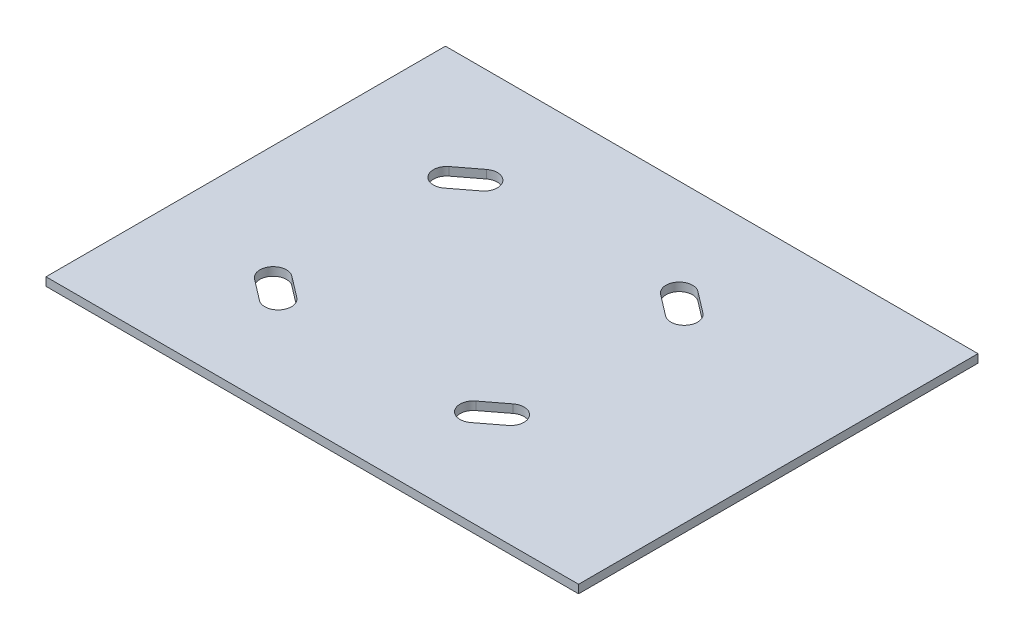
ISO-10303-21;
HEADER;
FILE_DESCRIPTION(('STEP AP214'),'2;1');
FILE_NAME('part.step','',(''),(''),'','','');
FILE_SCHEMA(('AUTOMOTIVE_DESIGN { 1 0 10303 214 1 1 1 1 }'));
ENDSEC;
DATA;
#1=APPLICATION_CONTEXT('core data for automotive mechanical design processes');
#2=APPLICATION_PROTOCOL_DEFINITION('international standard','automotive_design',2000,#1);
#3=PRODUCT_CONTEXT('',#1,'mechanical');
#4=PRODUCT('Part','Part','',(#3));
#5=PRODUCT_RELATED_PRODUCT_CATEGORY('part','',(#4));
#6=PRODUCT_DEFINITION_FORMATION('','',#4);
#7=PRODUCT_DEFINITION_CONTEXT('part definition',#1,'design');
#8=PRODUCT_DEFINITION('design','',#6,#7);
#9=PRODUCT_DEFINITION_SHAPE('','',#8);
#10=(LENGTH_UNIT() NAMED_UNIT(*) SI_UNIT(.MILLI.,.METRE.));
#11=(NAMED_UNIT(*) PLANE_ANGLE_UNIT() SI_UNIT($,.RADIAN.));
#12=(NAMED_UNIT(*) SI_UNIT($,.STERADIAN.) SOLID_ANGLE_UNIT());
#13=UNCERTAINTY_MEASURE_WITH_UNIT(LENGTH_MEASURE(1.E-05),#10,'distance_accuracy_value','');
#14=(GEOMETRIC_REPRESENTATION_CONTEXT(3) GLOBAL_UNCERTAINTY_ASSIGNED_CONTEXT((#13)) GLOBAL_UNIT_ASSIGNED_CONTEXT((#10,
#11,#12)) REPRESENTATION_CONTEXT('',''));
#15=CARTESIAN_POINT('',(0.,0.,0.));
#16=DIRECTION('',(0.,0.,1.));
#17=DIRECTION('',(1.,0.,0.));
#18=AXIS2_PLACEMENT_3D('',#15,#16,#17);
#19=CARTESIAN_POINT('',(35.7814142320492,3.175,46.7910801496027));
#20=DIRECTION('',(0.607450107570798,0.,0.794357832977196));
#21=DIRECTION('',(0.794357832977196,0.,-0.607450107570798));
#22=AXIS2_PLACEMENT_3D('',#19,#20,#21);
#23=PLANE('',#22);
#24=DIRECTION('',(-0.794357832977196,0.,0.607450107570798));
#25=VECTOR('',#24,1.);
#26=CARTESIAN_POINT('',(35.7814142320492,0.,46.7910801496027));
#27=LINE('',#26,#25);
#28=CARTESIAN_POINT('',(48.3961843379838,0.,37.1444912450645));
#29=VERTEX_POINT('',#28);
#30=CARTESIAN_POINT('',(40.3255087549355,0.,43.3161843379838));
#31=VERTEX_POINT('',#30);
#32=EDGE_CURVE('E250',#29,#31,#27,.T.);
#33=ORIENTED_EDGE('',*,*,#32,.T.);
#34=DIRECTION('',(0.,-1.,0.));
#35=VECTOR('',#34,1.);
#36=CARTESIAN_POINT('',(40.3255087549355,3.175,43.3161843379838));
#37=LINE('',#36,#35);
#38=CARTESIAN_POINT('',(40.3255087549355,3.175,43.3161843379838));
#39=VERTEX_POINT('',#38);
#40=EDGE_CURVE('E11',#39,#31,#37,.T.);
#41=ORIENTED_EDGE('',*,*,#40,.F.);
#42=DIRECTION('',(-0.794357832977196,0.,0.607450107570798));
#43=VECTOR('',#42,1.);
#44=CARTESIAN_POINT('',(35.7814142320492,3.175,46.7910801496027));
#45=LINE('',#44,#43);
#46=CARTESIAN_POINT('',(48.3961843379838,3.175,37.1444912450645));
#47=VERTEX_POINT('',#46);
#48=EDGE_CURVE('E185',#47,#39,#45,.T.);
#49=ORIENTED_EDGE('',*,*,#48,.F.);
#50=DIRECTION('',(0.,-1.,0.));
#51=VECTOR('',#50,1.);
#52=CARTESIAN_POINT('',(48.3961843379838,3.175,37.1444912450645));
#53=LINE('',#52,#51);
#54=EDGE_CURVE('E53',#47,#29,#53,.T.);
#55=ORIENTED_EDGE('',*,*,#54,.T.);
#56=EDGE_LOOP('',(#33,#41,#49,#55));
#57=FACE_BOUND('',#56,.T.);
#58=ADVANCED_FACE('F34',(#57),#23,.F.);
#59=CARTESIAN_POINT('',(37.2396622084758,3.175,39.2808465464596));
#60=DIRECTION('',(0.,-1.,0.));
#61=DIRECTION('',(0.,0.,-1.));
#62=AXIS2_PLACEMENT_3D('',#59,#60,#61);
#63=CYLINDRICAL_SURFACE('',#62,5.08000000000001);
#64=CARTESIAN_POINT('',(37.2396622084758,0.,39.2808465464596));
#65=DIRECTION('',(0.,1.,0.));
#66=DIRECTION('',(0.,0.,1.));
#67=AXIS2_PLACEMENT_3D('',#64,#65,#66);
#68=CIRCLE('',#67,5.08000000000001);
#69=CARTESIAN_POINT('',(34.1538156620162,0.,35.2455087549355));
#70=VERTEX_POINT('',#69);
#71=EDGE_CURVE('E191',#31,#70,#68,.F.);
#72=ORIENTED_EDGE('',*,*,#71,.T.);
#73=DIRECTION('',(0.,-1.,0.));
#74=VECTOR('',#73,1.);
#75=CARTESIAN_POINT('',(34.1538156620162,3.175,35.2455087549355));
#76=LINE('',#75,#74);
#77=CARTESIAN_POINT('',(34.1538156620162,3.175,35.2455087549355));
#78=VERTEX_POINT('',#77);
#79=EDGE_CURVE('E44',#78,#70,#76,.T.);
#80=ORIENTED_EDGE('',*,*,#79,.F.);
#81=CARTESIAN_POINT('',(37.2396622084758,3.175,39.2808465464596));
#82=DIRECTION('',(0.,1.,0.));
#83=DIRECTION('',(0.,0.,1.));
#84=AXIS2_PLACEMENT_3D('',#81,#82,#83);
#85=CIRCLE('',#84,5.08000000000001);
#86=EDGE_CURVE('E179',#39,#78,#85,.F.);
#87=ORIENTED_EDGE('',*,*,#86,.F.);
#88=ORIENTED_EDGE('',*,*,#40,.T.);
#89=EDGE_LOOP('',(#72,#80,#87,#88));
#90=FACE_BOUND('',#89,.T.);
#91=ADVANCED_FACE('F190',(#90),#63,.F.);
#92=CARTESIAN_POINT('',(29.6097211391298,3.175,38.7204045665544));
#93=DIRECTION('',(-0.607450107570796,0.,-0.794357832977197));
#94=DIRECTION('',(-0.794357832977197,0.,0.607450107570796));
#95=AXIS2_PLACEMENT_3D('',#92,#93,#94);
#96=PLANE('',#95);
#97=DIRECTION('',(0.794357832977197,0.,-0.607450107570796));
#98=VECTOR('',#97,1.);
#99=CARTESIAN_POINT('',(29.6097211391298,0.,38.7204045665544));
#100=LINE('',#99,#98);
#101=CARTESIAN_POINT('',(42.2244912450645,0.,29.0738156620162));
#102=VERTEX_POINT('',#101);
#103=EDGE_CURVE('E253',#70,#102,#100,.T.);
#104=ORIENTED_EDGE('',*,*,#103,.T.);
#105=DIRECTION('',(0.,-1.,0.));
#106=VECTOR('',#105,1.);
#107=CARTESIAN_POINT('',(42.2244912450645,3.175,29.0738156620162));
#108=LINE('',#107,#106);
#109=CARTESIAN_POINT('',(42.2244912450645,3.175,29.0738156620162));
#110=VERTEX_POINT('',#109);
#111=EDGE_CURVE('E116',#110,#102,#108,.T.);
#112=ORIENTED_EDGE('',*,*,#111,.F.);
#113=DIRECTION('',(0.794357832977197,0.,-0.607450107570796));
#114=VECTOR('',#113,1.);
#115=CARTESIAN_POINT('',(29.6097211391298,3.175,38.7204045665544));
#116=LINE('',#115,#114);
#117=EDGE_CURVE('E184',#78,#110,#116,.T.);
#118=ORIENTED_EDGE('',*,*,#117,.F.);
#119=ORIENTED_EDGE('',*,*,#79,.T.);
#120=EDGE_LOOP('',(#104,#112,#118,#119));
#121=FACE_BOUND('',#120,.T.);
#122=ADVANCED_FACE('F195',(#121),#96,.F.);
#123=CARTESIAN_POINT('',(37.2396622084758,3.175,-39.2808465464596));
#124=DIRECTION('',(0.,-1.,0.));
#125=DIRECTION('',(0.,0.,-1.));
#126=AXIS2_PLACEMENT_3D('',#123,#124,#125);
#127=CYLINDRICAL_SURFACE('',#126,5.08000000000001);
#128=CARTESIAN_POINT('',(37.2396622084758,0.,-39.2808465464596));
#129=DIRECTION('',(0.,1.,0.));
#130=DIRECTION('',(0.,0.,1.));
#131=AXIS2_PLACEMENT_3D('',#128,#129,#130);
#132=CIRCLE('',#131,5.08000000000001);
#133=CARTESIAN_POINT('',(40.3255087549355,0.,-43.3161843379838));
#134=VERTEX_POINT('',#133);
#135=CARTESIAN_POINT('',(34.1538156620162,0.,-35.2455087549355));
#136=VERTEX_POINT('',#135);
#137=EDGE_CURVE('E238',#134,#136,#132,.T.);
#138=ORIENTED_EDGE('',*,*,#137,.F.);
#139=DIRECTION('',(0.,-1.,0.));
#140=VECTOR('',#139,1.);
#141=CARTESIAN_POINT('',(40.3255087549355,3.175,-43.3161843379838));
#142=LINE('',#141,#140);
#143=CARTESIAN_POINT('',(40.3255087549355,3.175,-43.3161843379838));
#144=VERTEX_POINT('',#143);
#145=EDGE_CURVE('E260',#144,#134,#142,.T.);
#146=ORIENTED_EDGE('',*,*,#145,.F.);
#147=CARTESIAN_POINT('',(37.2396622084758,3.175,-39.2808465464596));
#148=DIRECTION('',(0.,1.,0.));
#149=DIRECTION('',(0.,0.,1.));
#150=AXIS2_PLACEMENT_3D('',#147,#148,#149);
#151=CIRCLE('',#150,5.08000000000001);
#152=CARTESIAN_POINT('',(34.1538156620162,3.175,-35.2455087549355));
#153=VERTEX_POINT('',#152);
#154=EDGE_CURVE('E339',#144,#153,#151,.T.);
#155=ORIENTED_EDGE('',*,*,#154,.T.);
#156=DIRECTION('',(0.,-1.,0.));
#157=VECTOR('',#156,1.);
#158=CARTESIAN_POINT('',(34.1538156620162,3.175,-35.2455087549355));
#159=LINE('',#158,#157);
#160=EDGE_CURVE('E262',#153,#136,#159,.T.);
#161=ORIENTED_EDGE('',*,*,#160,.T.);
#162=EDGE_LOOP('',(#138,#146,#155,#161));
#163=FACE_BOUND('',#162,.T.);
#164=ADVANCED_FACE('F366',(#163),#127,.F.);
#165=CARTESIAN_POINT('',(35.7814142320492,3.175,-46.7910801496027));
#166=DIRECTION('',(-0.607450107570798,0.,0.794357832977196));
#167=DIRECTION('',(0.794357832977196,0.,0.607450107570798));
#168=AXIS2_PLACEMENT_3D('',#165,#166,#167);
#169=PLANE('',#168);
#170=DIRECTION('',(-0.794357832977196,0.,-0.607450107570798));
#171=VECTOR('',#170,1.);
#172=CARTESIAN_POINT('',(35.7814142320492,0.,-46.7910801496027));
#173=LINE('',#172,#171);
#174=CARTESIAN_POINT('',(48.3961843379838,0.,-37.1444912450645));
#175=VERTEX_POINT('',#174);
#176=EDGE_CURVE('E241',#175,#134,#173,.T.);
#177=ORIENTED_EDGE('',*,*,#176,.F.);
#178=DIRECTION('',(0.,-1.,0.));
#179=VECTOR('',#178,1.);
#180=CARTESIAN_POINT('',(48.3961843379838,3.175,-37.1444912450645));
#181=LINE('',#180,#179);
#182=CARTESIAN_POINT('',(48.3961843379838,3.175,-37.1444912450645));
#183=VERTEX_POINT('',#182);
#184=EDGE_CURVE('E267',#183,#175,#181,.T.);
#185=ORIENTED_EDGE('',*,*,#184,.F.);
#186=DIRECTION('',(-0.794357832977196,0.,-0.607450107570798));
#187=VECTOR('',#186,1.);
#188=CARTESIAN_POINT('',(35.7814142320492,3.175,-46.7910801496027));
#189=LINE('',#188,#187);
#190=EDGE_CURVE('E342',#183,#144,#189,.T.);
#191=ORIENTED_EDGE('',*,*,#190,.T.);
#192=ORIENTED_EDGE('',*,*,#145,.T.);
#193=EDGE_LOOP('',(#177,#185,#191,#192));
#194=FACE_BOUND('',#193,.T.);
#195=ADVANCED_FACE('F368',(#194),#169,.T.);
#196=CARTESIAN_POINT('',(45.3103377915242,3.175,-33.1091534535403));
#197=DIRECTION('',(0.,-1.,0.));
#198=DIRECTION('',(0.,0.,-1.));
#199=AXIS2_PLACEMENT_3D('',#196,#197,#198);
#200=CYLINDRICAL_SURFACE('',#199,5.08);
#201=CARTESIAN_POINT('',(45.3103377915242,0.,-33.1091534535403));
#202=DIRECTION('',(0.,1.,0.));
#203=DIRECTION('',(0.,0.,1.));
#204=AXIS2_PLACEMENT_3D('',#201,#202,#203);
#205=CIRCLE('',#204,5.08);
#206=CARTESIAN_POINT('',(42.2244912450645,0.,-29.0738156620162));
#207=VERTEX_POINT('',#206);
#208=EDGE_CURVE('E244',#175,#207,#205,.F.);
#209=ORIENTED_EDGE('',*,*,#208,.T.);
#210=DIRECTION('',(0.,-1.,0.));
#211=VECTOR('',#210,1.);
#212=CARTESIAN_POINT('',(42.2244912450645,3.175,-29.0738156620162));
#213=LINE('',#212,#211);
#214=CARTESIAN_POINT('',(42.2244912450645,3.175,-29.0738156620162));
#215=VERTEX_POINT('',#214);
#216=EDGE_CURVE('E264',#215,#207,#213,.T.);
#217=ORIENTED_EDGE('',*,*,#216,.F.);
#218=CARTESIAN_POINT('',(45.3103377915242,3.175,-33.1091534535403));
#219=DIRECTION('',(0.,1.,0.));
#220=DIRECTION('',(0.,0.,1.));
#221=AXIS2_PLACEMENT_3D('',#218,#219,#220);
#222=CIRCLE('',#221,5.08);
#223=EDGE_CURVE('E345',#183,#215,#222,.F.);
#224=ORIENTED_EDGE('',*,*,#223,.F.);
#225=ORIENTED_EDGE('',*,*,#184,.T.);
#226=EDGE_LOOP('',(#209,#217,#224,#225));
#227=FACE_BOUND('',#226,.T.);
#228=ADVANCED_FACE('F359',(#227),#200,.F.);
#229=CARTESIAN_POINT('',(-45.3103377915242,3.175,-33.1091534535403));
#230=DIRECTION('',(0.,-1.,0.));
#231=DIRECTION('',(0.,0.,-1.));
#232=AXIS2_PLACEMENT_3D('',#229,#230,#231);
#233=CYLINDRICAL_SURFACE('',#232,5.08000000000001);
#234=CARTESIAN_POINT('',(-45.3103377915242,0.,-33.1091534535403));
#235=DIRECTION('',(0.,1.,0.));
#236=DIRECTION('',(0.,0.,1.));
#237=AXIS2_PLACEMENT_3D('',#234,#235,#236);
#238=CIRCLE('',#237,5.08000000000001);
#239=CARTESIAN_POINT('',(-48.3961843379838,0.,-37.1444912450645));
#240=VERTEX_POINT('',#239);
#241=CARTESIAN_POINT('',(-42.2244912450645,0.,-29.0738156620162));
#242=VERTEX_POINT('',#241);
#243=EDGE_CURVE('E226',#240,#242,#238,.T.);
#244=ORIENTED_EDGE('',*,*,#243,.F.);
#245=DIRECTION('',(0.,-1.,0.));
#246=VECTOR('',#245,1.);
#247=CARTESIAN_POINT('',(-48.3961843379838,3.175,-37.1444912450645));
#248=LINE('',#247,#246);
#249=CARTESIAN_POINT('',(-48.3961843379838,3.175,-37.1444912450645));
#250=VERTEX_POINT('',#249);
#251=EDGE_CURVE('E265',#250,#240,#248,.T.);
#252=ORIENTED_EDGE('',*,*,#251,.F.);
#253=CARTESIAN_POINT('',(-45.3103377915242,3.175,-33.1091534535403));
#254=DIRECTION('',(0.,1.,0.));
#255=DIRECTION('',(0.,0.,1.));
#256=AXIS2_PLACEMENT_3D('',#253,#254,#255);
#257=CIRCLE('',#256,5.08000000000001);
#258=CARTESIAN_POINT('',(-42.2244912450645,3.175,-29.0738156620162));
#259=VERTEX_POINT('',#258);
#260=EDGE_CURVE('E328',#250,#259,#257,.T.);
#261=ORIENTED_EDGE('',*,*,#260,.T.);
#262=DIRECTION('',(0.,-1.,0.));
#263=VECTOR('',#262,1.);
#264=CARTESIAN_POINT('',(-42.2244912450645,3.175,-29.0738156620162));
#265=LINE('',#264,#263);
#266=EDGE_CURVE('E270',#259,#242,#265,.T.);
#267=ORIENTED_EDGE('',*,*,#266,.T.);
#268=EDGE_LOOP('',(#244,#252,#261,#267));
#269=FACE_BOUND('',#268,.T.);
#270=ADVANCED_FACE('F375',(#269),#233,.F.);
#271=CARTESIAN_POINT('',(-35.7814142320492,3.175,-46.7910801496027));
#272=DIRECTION('',(-0.607450107570797,0.,-0.794357832977196));
#273=DIRECTION('',(-0.794357832977196,0.,0.607450107570797));
#274=AXIS2_PLACEMENT_3D('',#271,#272,#273);
#275=PLANE('',#274);
#276=DIRECTION('',(0.794357832977196,0.,-0.607450107570797));
#277=VECTOR('',#276,1.);
#278=CARTESIAN_POINT('',(-35.7814142320492,0.,-46.7910801496027));
#279=LINE('',#278,#277);
#280=CARTESIAN_POINT('',(-40.3255087549355,0.,-43.3161843379838));
#281=VERTEX_POINT('',#280);
#282=EDGE_CURVE('E229',#240,#281,#279,.T.);
#283=ORIENTED_EDGE('',*,*,#282,.T.);
#284=DIRECTION('',(0.,-1.,0.));
#285=VECTOR('',#284,1.);
#286=CARTESIAN_POINT('',(-40.3255087549355,3.175,-43.3161843379838));
#287=LINE('',#286,#285);
#288=CARTESIAN_POINT('',(-40.3255087549355,3.175,-43.3161843379838));
#289=VERTEX_POINT('',#288);
#290=EDGE_CURVE('E276',#289,#281,#287,.T.);
#291=ORIENTED_EDGE('',*,*,#290,.F.);
#292=DIRECTION('',(0.794357832977196,0.,-0.607450107570797));
#293=VECTOR('',#292,1.);
#294=CARTESIAN_POINT('',(-35.7814142320492,3.175,-46.7910801496027));
#295=LINE('',#294,#293);
#296=EDGE_CURVE('E331',#250,#289,#295,.T.);
#297=ORIENTED_EDGE('',*,*,#296,.F.);
#298=ORIENTED_EDGE('',*,*,#251,.T.);
#299=EDGE_LOOP('',(#283,#291,#297,#298));
#300=FACE_BOUND('',#299,.T.);
#301=ADVANCED_FACE('F421',(#300),#275,.F.);
#302=CARTESIAN_POINT('',(-37.2396622084758,3.175,-39.2808465464596));
#303=DIRECTION('',(0.,-1.,0.));
#304=DIRECTION('',(0.,0.,-1.));
#305=AXIS2_PLACEMENT_3D('',#302,#303,#304);
#306=CYLINDRICAL_SURFACE('',#305,5.08000000000001);
#307=CARTESIAN_POINT('',(-37.2396622084758,0.,-39.2808465464596));
#308=DIRECTION('',(0.,1.,0.));
#309=DIRECTION('',(0.,0.,1.));
#310=AXIS2_PLACEMENT_3D('',#307,#308,#309);
#311=CIRCLE('',#310,5.08000000000001);
#312=CARTESIAN_POINT('',(-34.1538156620162,0.,-35.2455087549355));
#313=VERTEX_POINT('',#312);
#314=EDGE_CURVE('E232',#281,#313,#311,.F.);
#315=ORIENTED_EDGE('',*,*,#314,.T.);
#316=DIRECTION('',(0.,-1.,0.));
#317=VECTOR('',#316,1.);
#318=CARTESIAN_POINT('',(-34.1538156620162,3.175,-35.2455087549355));
#319=LINE('',#318,#317);
#320=CARTESIAN_POINT('',(-34.1538156620162,3.175,-35.2455087549355));
#321=VERTEX_POINT('',#320);
#322=EDGE_CURVE('E272',#321,#313,#319,.T.);
#323=ORIENTED_EDGE('',*,*,#322,.F.);
#324=CARTESIAN_POINT('',(-37.2396622084758,3.175,-39.2808465464596));
#325=DIRECTION('',(0.,1.,0.));
#326=DIRECTION('',(0.,0.,1.));
#327=AXIS2_PLACEMENT_3D('',#324,#325,#326);
#328=CIRCLE('',#327,5.08000000000001);
#329=EDGE_CURVE('E334',#289,#321,#328,.F.);
#330=ORIENTED_EDGE('',*,*,#329,.F.);
#331=ORIENTED_EDGE('',*,*,#290,.T.);
#332=EDGE_LOOP('',(#315,#323,#330,#331));
#333=FACE_BOUND('',#332,.T.);
#334=ADVANCED_FACE('F407',(#333),#306,.F.);
#335=CARTESIAN_POINT('',(-88.9,3.175,0.));
#336=DIRECTION('',(-1.,0.,0.));
#337=DIRECTION('',(0.,0.,1.));
#338=AXIS2_PLACEMENT_3D('',#335,#336,#337);
#339=PLANE('',#338);
#340=DIRECTION('',(0.,0.,-1.));
#341=VECTOR('',#340,1.);
#342=CARTESIAN_POINT('',(-88.9,0.,0.));
#343=LINE('',#342,#341);
#344=CARTESIAN_POINT('',(-88.9,0.,76.2));
#345=VERTEX_POINT('',#344);
#346=CARTESIAN_POINT('',(-88.9,0.,-76.2));
#347=VERTEX_POINT('',#346);
#348=EDGE_CURVE('E214',#345,#347,#343,.T.);
#349=ORIENTED_EDGE('',*,*,#348,.F.);
#350=DIRECTION('',(0.,-1.,0.));
#351=VECTOR('',#350,1.);
#352=CARTESIAN_POINT('',(-88.9,3.175,76.2));
#353=LINE('',#352,#351);
#354=CARTESIAN_POINT('',(-88.9,3.175,76.2));
#355=VERTEX_POINT('',#354);
#356=EDGE_CURVE('E273',#355,#345,#353,.T.);
#357=ORIENTED_EDGE('',*,*,#356,.F.);
#358=DIRECTION('',(0.,0.,-1.));
#359=VECTOR('',#358,1.);
#360=CARTESIAN_POINT('',(-88.9,3.175,0.));
#361=LINE('',#360,#359);
#362=CARTESIAN_POINT('',(-88.9,3.175,-76.2));
#363=VERTEX_POINT('',#362);
#364=EDGE_CURVE('E313',#355,#363,#361,.T.);
#365=ORIENTED_EDGE('',*,*,#364,.T.);
#366=DIRECTION('',(0.,-1.,0.));
#367=VECTOR('',#366,1.);
#368=CARTESIAN_POINT('',(-88.9,3.175,-76.2));
#369=LINE('',#368,#367);
#370=EDGE_CURVE('E280',#363,#347,#369,.T.);
#371=ORIENTED_EDGE('',*,*,#370,.T.);
#372=EDGE_LOOP('',(#349,#357,#365,#371));
#373=FACE_BOUND('',#372,.T.);
#374=ADVANCED_FACE('F403',(#373),#339,.T.);
#375=CARTESIAN_POINT('',(0.,3.175,76.2));
#376=DIRECTION('',(0.,0.,1.));
#377=DIRECTION('',(1.,0.,0.));
#378=AXIS2_PLACEMENT_3D('',#375,#376,#377);
#379=PLANE('',#378);
#380=DIRECTION('',(-1.,0.,0.));
#381=VECTOR('',#380,1.);
#382=CARTESIAN_POINT('',(0.,0.,76.2));
#383=LINE('',#382,#381);
#384=CARTESIAN_POINT('',(114.3,0.,76.2));
#385=VERTEX_POINT('',#384);
#386=EDGE_CURVE('E217',#385,#345,#383,.T.);
#387=ORIENTED_EDGE('',*,*,#386,.F.);
#388=DIRECTION('',(0.,-1.,0.));
#389=VECTOR('',#388,1.);
#390=CARTESIAN_POINT('',(114.3,3.175,76.2));
#391=LINE('',#390,#389);
#392=CARTESIAN_POINT('',(114.3,3.175,76.2));
#393=VERTEX_POINT('',#392);
#394=EDGE_CURVE('E285',#393,#385,#391,.T.);
#395=ORIENTED_EDGE('',*,*,#394,.F.);
#396=DIRECTION('',(-1.,0.,0.));
#397=VECTOR('',#396,1.);
#398=CARTESIAN_POINT('',(0.,3.175,76.2));
#399=LINE('',#398,#397);
#400=EDGE_CURVE('E316',#393,#355,#399,.T.);
#401=ORIENTED_EDGE('',*,*,#400,.T.);
#402=ORIENTED_EDGE('',*,*,#356,.T.);
#403=EDGE_LOOP('',(#387,#395,#401,#402));
#404=FACE_BOUND('',#403,.T.);
#405=ADVANCED_FACE('F406',(#404),#379,.T.);
#406=CARTESIAN_POINT('',(114.3,3.175,0.));
#407=DIRECTION('',(-1.,0.,0.));
#408=DIRECTION('',(0.,0.,1.));
#409=AXIS2_PLACEMENT_3D('',#406,#407,#408);
#410=PLANE('',#409);
#411=DIRECTION('',(0.,0.,-1.));
#412=VECTOR('',#411,1.);
#413=CARTESIAN_POINT('',(114.3,0.,0.));
#414=LINE('',#413,#412);
#415=CARTESIAN_POINT('',(114.3,0.,-76.2));
#416=VERTEX_POINT('',#415);
#417=EDGE_CURVE('E220',#385,#416,#414,.T.);
#418=ORIENTED_EDGE('',*,*,#417,.T.);
#419=DIRECTION('',(0.,-1.,0.));
#420=VECTOR('',#419,1.);
#421=CARTESIAN_POINT('',(114.3,3.175,-76.2));
#422=LINE('',#421,#420);
#423=CARTESIAN_POINT('',(114.3,3.175,-76.2));
#424=VERTEX_POINT('',#423);
#425=EDGE_CURVE('E282',#424,#416,#422,.T.);
#426=ORIENTED_EDGE('',*,*,#425,.F.);
#427=DIRECTION('',(0.,0.,-1.));
#428=VECTOR('',#427,1.);
#429=CARTESIAN_POINT('',(114.3,3.175,0.));
#430=LINE('',#429,#428);
#431=EDGE_CURVE('E323',#393,#424,#430,.T.);
#432=ORIENTED_EDGE('',*,*,#431,.F.);
#433=ORIENTED_EDGE('',*,*,#394,.T.);
#434=EDGE_LOOP('',(#418,#426,#432,#433));
#435=FACE_BOUND('',#434,.T.);
#436=ADVANCED_FACE('F411',(#435),#410,.F.);
#437=CARTESIAN_POINT('',(-37.2396622084758,3.175,39.2808465464596));
#438=DIRECTION('',(0.,-1.,0.));
#439=DIRECTION('',(0.,0.,-1.));
#440=AXIS2_PLACEMENT_3D('',#437,#438,#439);
#441=CYLINDRICAL_SURFACE('',#440,5.07999999999999);
#442=CARTESIAN_POINT('',(-37.2396622084758,0.,39.2808465464596));
#443=DIRECTION('',(0.,1.,0.));
#444=DIRECTION('',(0.,0.,1.));
#445=AXIS2_PLACEMENT_3D('',#442,#443,#444);
#446=CIRCLE('',#445,5.07999999999999);
#447=CARTESIAN_POINT('',(-40.3255087549355,0.,43.3161843379838));
#448=VERTEX_POINT('',#447);
#449=CARTESIAN_POINT('',(-34.1538156620162,0.,35.2455087549355));
#450=VERTEX_POINT('',#449);
#451=EDGE_CURVE('E202',#448,#450,#446,.T.);
#452=ORIENTED_EDGE('',*,*,#451,.F.);
#453=DIRECTION('',(0.,-1.,0.));
#454=VECTOR('',#453,1.);
#455=CARTESIAN_POINT('',(-40.3255087549355,3.175,43.3161843379838));
#456=LINE('',#455,#454);
#457=CARTESIAN_POINT('',(-40.3255087549355,3.175,43.3161843379838));
#458=VERTEX_POINT('',#457);
#459=EDGE_CURVE('E38',#458,#448,#456,.T.);
#460=ORIENTED_EDGE('',*,*,#459,.F.);
#461=CARTESIAN_POINT('',(-37.2396622084758,3.175,39.2808465464596));
#462=DIRECTION('',(0.,1.,0.));
#463=DIRECTION('',(0.,0.,1.));
#464=AXIS2_PLACEMENT_3D('',#461,#462,#463);
#465=CIRCLE('',#464,5.07999999999999);
#466=CARTESIAN_POINT('',(-34.1538156620162,3.175,35.2455087549355));
#467=VERTEX_POINT('',#466);
#468=EDGE_CURVE('E258',#458,#467,#465,.T.);
#469=ORIENTED_EDGE('',*,*,#468,.T.);
#470=DIRECTION('',(0.,-1.,0.));
#471=VECTOR('',#470,1.);
#472=CARTESIAN_POINT('',(-34.1538156620162,3.175,35.2455087549355));
#473=LINE('',#472,#471);
#474=EDGE_CURVE('E198',#467,#450,#473,.T.);
#475=ORIENTED_EDGE('',*,*,#474,.T.);
#476=EDGE_LOOP('',(#452,#460,#469,#475));
#477=FACE_BOUND('',#476,.T.);
#478=ADVANCED_FACE('F36',(#477),#441,.F.);
#479=CARTESIAN_POINT('',(-35.7814142320492,3.175,46.7910801496027));
#480=DIRECTION('',(0.607450107570798,0.,-0.794357832977196));
#481=DIRECTION('',(-0.794357832977196,0.,-0.607450107570798));
#482=AXIS2_PLACEMENT_3D('',#479,#480,#481);
#483=PLANE('',#482);
#484=DIRECTION('',(0.794357832977196,0.,0.607450107570798));
#485=VECTOR('',#484,1.);
#486=CARTESIAN_POINT('',(-35.7814142320492,0.,46.7910801496027));
#487=LINE('',#486,#485);
#488=CARTESIAN_POINT('',(-48.3961843379838,0.,37.1444912450645));
#489=VERTEX_POINT('',#488);
#490=EDGE_CURVE('E205',#489,#448,#487,.T.);
#491=ORIENTED_EDGE('',*,*,#490,.F.);
#492=DIRECTION('',(0.,-1.,0.));
#493=VECTOR('',#492,1.);
#494=CARTESIAN_POINT('',(-48.3961843379838,3.175,37.1444912450645));
#495=LINE('',#494,#493);
#496=CARTESIAN_POINT('',(-48.3961843379838,3.175,37.1444912450645));
#497=VERTEX_POINT('',#496);
#498=EDGE_CURVE('E290',#497,#489,#495,.T.);
#499=ORIENTED_EDGE('',*,*,#498,.F.);
#500=DIRECTION('',(0.794357832977196,0.,0.607450107570798));
#501=VECTOR('',#500,1.);
#502=CARTESIAN_POINT('',(-35.7814142320492,3.175,46.7910801496027));
#503=LINE('',#502,#501);
#504=EDGE_CURVE('E299',#497,#458,#503,.T.);
#505=ORIENTED_EDGE('',*,*,#504,.T.);
#506=ORIENTED_EDGE('',*,*,#459,.T.);
#507=EDGE_LOOP('',(#491,#499,#505,#506));
#508=FACE_BOUND('',#507,.T.);
#509=ADVANCED_FACE('F297',(#508),#483,.T.);
#510=CARTESIAN_POINT('',(-45.3103377915242,3.175,33.1091534535403));
#511=DIRECTION('',(0.,-1.,0.));
#512=DIRECTION('',(0.,0.,-1.));
#513=AXIS2_PLACEMENT_3D('',#510,#511,#512);
#514=CYLINDRICAL_SURFACE('',#513,5.08);
#515=CARTESIAN_POINT('',(-45.3103377915242,0.,33.1091534535403));
#516=DIRECTION('',(0.,1.,0.));
#517=DIRECTION('',(0.,0.,1.));
#518=AXIS2_PLACEMENT_3D('',#515,#516,#517);
#519=CIRCLE('',#518,5.08);
#520=CARTESIAN_POINT('',(-42.2244912450645,0.,29.0738156620161));
#521=VERTEX_POINT('',#520);
#522=EDGE_CURVE('E208',#489,#521,#519,.F.);
#523=ORIENTED_EDGE('',*,*,#522,.T.);
#524=DIRECTION('',(0.,-1.,0.));
#525=VECTOR('',#524,1.);
#526=CARTESIAN_POINT('',(-42.2244912450645,3.175,29.0738156620161));
#527=LINE('',#526,#525);
#528=CARTESIAN_POINT('',(-42.2244912450645,3.175,29.0738156620161));
#529=VERTEX_POINT('',#528);
#530=EDGE_CURVE('E289',#529,#521,#527,.T.);
#531=ORIENTED_EDGE('',*,*,#530,.F.);
#532=CARTESIAN_POINT('',(-45.3103377915242,3.175,33.1091534535403));
#533=DIRECTION('',(0.,1.,0.));
#534=DIRECTION('',(0.,0.,1.));
#535=AXIS2_PLACEMENT_3D('',#532,#533,#534);
#536=CIRCLE('',#535,5.08);
#537=EDGE_CURVE('E307',#497,#529,#536,.F.);
#538=ORIENTED_EDGE('',*,*,#537,.F.);
#539=ORIENTED_EDGE('',*,*,#498,.T.);
#540=EDGE_LOOP('',(#523,#531,#538,#539));
#541=FACE_BOUND('',#540,.T.);
#542=ADVANCED_FACE('F305',(#541),#514,.F.);
#543=CARTESIAN_POINT('',(29.6097211391298,3.175,-38.7204045665544));
#544=DIRECTION('',(0.607450107570796,0.,-0.794357832977197));
#545=DIRECTION('',(-0.794357832977197,0.,-0.607450107570796));
#546=AXIS2_PLACEMENT_3D('',#543,#544,#545);
#547=PLANE('',#546);
#548=DIRECTION('',(0.794357832977197,0.,0.607450107570796));
#549=VECTOR('',#548,1.);
#550=CARTESIAN_POINT('',(29.6097211391298,0.,-38.7204045665544));
#551=LINE('',#550,#549);
#552=EDGE_CURVE('E247',#136,#207,#551,.T.);
#553=ORIENTED_EDGE('',*,*,#552,.F.);
#554=ORIENTED_EDGE('',*,*,#160,.F.);
#555=DIRECTION('',(0.794357832977197,0.,0.607450107570796));
#556=VECTOR('',#555,1.);
#557=CARTESIAN_POINT('',(29.6097211391298,3.175,-38.7204045665544));
#558=LINE('',#557,#556);
#559=EDGE_CURVE('E347',#153,#215,#558,.T.);
#560=ORIENTED_EDGE('',*,*,#559,.T.);
#561=ORIENTED_EDGE('',*,*,#216,.T.);
#562=EDGE_LOOP('',(#553,#554,#560,#561));
#563=FACE_BOUND('',#562,.T.);
#564=ADVANCED_FACE('F352',(#563),#547,.T.);
#565=CARTESIAN_POINT('',(-29.6097211391298,3.175,-38.7204045665544));
#566=DIRECTION('',(0.607450107570796,0.,0.794357832977197));
#567=DIRECTION('',(0.794357832977197,0.,-0.607450107570796));
#568=AXIS2_PLACEMENT_3D('',#565,#566,#567);
#569=PLANE('',#568);
#570=DIRECTION('',(-0.794357832977197,0.,0.607450107570796));
#571=VECTOR('',#570,1.);
#572=CARTESIAN_POINT('',(-29.6097211391298,0.,-38.7204045665544));
#573=LINE('',#572,#571);
#574=EDGE_CURVE('E235',#313,#242,#573,.T.);
#575=ORIENTED_EDGE('',*,*,#574,.T.);
#576=ORIENTED_EDGE('',*,*,#266,.F.);
#577=DIRECTION('',(-0.794357832977197,0.,0.607450107570796));
#578=VECTOR('',#577,1.);
#579=CARTESIAN_POINT('',(-29.6097211391298,3.175,-38.7204045665544));
#580=LINE('',#579,#578);
#581=EDGE_CURVE('E337',#321,#259,#580,.T.);
#582=ORIENTED_EDGE('',*,*,#581,.F.);
#583=ORIENTED_EDGE('',*,*,#322,.T.);
#584=EDGE_LOOP('',(#575,#576,#582,#583));
#585=FACE_BOUND('',#584,.T.);
#586=ADVANCED_FACE('F387',(#585),#569,.F.);
#587=CARTESIAN_POINT('',(0.,3.175,-76.2));
#588=DIRECTION('',(0.,0.,1.));
#589=DIRECTION('',(1.,0.,0.));
#590=AXIS2_PLACEMENT_3D('',#587,#588,#589);
#591=PLANE('',#590);
#592=DIRECTION('',(-1.,0.,0.));
#593=VECTOR('',#592,1.);
#594=CARTESIAN_POINT('',(0.,0.,-76.2));
#595=LINE('',#594,#593);
#596=EDGE_CURVE('E223',#416,#347,#595,.T.);
#597=ORIENTED_EDGE('',*,*,#596,.T.);
#598=ORIENTED_EDGE('',*,*,#370,.F.);
#599=DIRECTION('',(-1.,0.,0.));
#600=VECTOR('',#599,1.);
#601=CARTESIAN_POINT('',(0.,3.175,-76.2));
#602=LINE('',#601,#600);
#603=EDGE_CURVE('E326',#424,#363,#602,.T.);
#604=ORIENTED_EDGE('',*,*,#603,.F.);
#605=ORIENTED_EDGE('',*,*,#425,.T.);
#606=EDGE_LOOP('',(#597,#598,#604,#605));
#607=FACE_BOUND('',#606,.T.);
#608=ADVANCED_FACE('F392',(#607),#591,.F.);
#609=CARTESIAN_POINT('',(-29.60972113913,3.175,38.7204045665544));
#610=DIRECTION('',(-0.6074501075708,0.,0.794357832977194));
#611=DIRECTION('',(0.794357832977194,0.,0.6074501075708));
#612=AXIS2_PLACEMENT_3D('',#609,#610,#611);
#613=PLANE('',#612);
#614=DIRECTION('',(-0.794357832977194,0.,-0.6074501075708));
#615=VECTOR('',#614,1.);
#616=CARTESIAN_POINT('',(-29.60972113913,0.,38.7204045665544));
#617=LINE('',#616,#615);
#618=EDGE_CURVE('E211',#450,#521,#617,.T.);
#619=ORIENTED_EDGE('',*,*,#618,.F.);
#620=ORIENTED_EDGE('',*,*,#474,.F.);
#621=DIRECTION('',(-0.794357832977194,0.,-0.6074501075708));
#622=VECTOR('',#621,1.);
#623=CARTESIAN_POINT('',(-29.60972113913,3.175,38.7204045665544));
#624=LINE('',#623,#622);
#625=EDGE_CURVE('E310',#467,#529,#624,.T.);
#626=ORIENTED_EDGE('',*,*,#625,.T.);
#627=ORIENTED_EDGE('',*,*,#530,.T.);
#628=EDGE_LOOP('',(#619,#620,#626,#627));
#629=FACE_BOUND('',#628,.T.);
#630=ADVANCED_FACE('F311',(#629),#613,.T.);
#631=CARTESIAN_POINT('',(45.3103377915242,3.175,33.1091534535403));
#632=DIRECTION('',(0.,-1.,0.));
#633=DIRECTION('',(0.,0.,-1.));
#634=AXIS2_PLACEMENT_3D('',#631,#632,#633);
#635=CYLINDRICAL_SURFACE('',#634,5.08);
#636=CARTESIAN_POINT('',(45.3103377915242,0.,33.1091534535403));
#637=DIRECTION('',(0.,1.,0.));
#638=DIRECTION('',(0.,0.,1.));
#639=AXIS2_PLACEMENT_3D('',#636,#637,#638);
#640=CIRCLE('',#639,5.08);
#641=EDGE_CURVE('E255',#29,#102,#640,.T.);
#642=ORIENTED_EDGE('',*,*,#641,.F.);
#643=ORIENTED_EDGE('',*,*,#54,.F.);
#644=CARTESIAN_POINT('',(45.3103377915242,3.175,33.1091534535403));
#645=DIRECTION('',(0.,1.,0.));
#646=DIRECTION('',(0.,0.,1.));
#647=AXIS2_PLACEMENT_3D('',#644,#645,#646);
#648=CIRCLE('',#647,5.08);
#649=EDGE_CURVE('E196',#47,#110,#648,.T.);
#650=ORIENTED_EDGE('',*,*,#649,.T.);
#651=ORIENTED_EDGE('',*,*,#111,.T.);
#652=EDGE_LOOP('',(#642,#643,#650,#651));
#653=FACE_BOUND('',#652,.T.);
#654=ADVANCED_FACE('F402',(#653),#635,.F.);
#655=CARTESIAN_POINT('',(0.,3.175,0.));
#656=DIRECTION('',(0.,1.,0.));
#657=DIRECTION('',(0.,0.,1.));
#658=AXIS2_PLACEMENT_3D('',#655,#656,#657);
#659=PLANE('',#658);
#660=ORIENTED_EDGE('',*,*,#468,.F.);
#661=ORIENTED_EDGE('',*,*,#504,.F.);
#662=ORIENTED_EDGE('',*,*,#537,.T.);
#663=ORIENTED_EDGE('',*,*,#625,.F.);
#664=EDGE_LOOP('',(#660,#661,#662,#663));
#665=FACE_BOUND('',#664,.T.);
#666=ORIENTED_EDGE('',*,*,#364,.F.);
#667=ORIENTED_EDGE('',*,*,#400,.F.);
#668=ORIENTED_EDGE('',*,*,#431,.T.);
#669=ORIENTED_EDGE('',*,*,#603,.T.);
#670=EDGE_LOOP('',(#666,#667,#668,#669));
#671=FACE_BOUND('',#670,.T.);
#672=ORIENTED_EDGE('',*,*,#260,.F.);
#673=ORIENTED_EDGE('',*,*,#296,.T.);
#674=ORIENTED_EDGE('',*,*,#329,.T.);
#675=ORIENTED_EDGE('',*,*,#581,.T.);
#676=EDGE_LOOP('',(#672,#673,#674,#675));
#677=FACE_BOUND('',#676,.T.);
#678=ORIENTED_EDGE('',*,*,#154,.F.);
#679=ORIENTED_EDGE('',*,*,#190,.F.);
#680=ORIENTED_EDGE('',*,*,#223,.T.);
#681=ORIENTED_EDGE('',*,*,#559,.F.);
#682=EDGE_LOOP('',(#678,#679,#680,#681));
#683=FACE_BOUND('',#682,.T.);
#684=ORIENTED_EDGE('',*,*,#48,.T.);
#685=ORIENTED_EDGE('',*,*,#86,.T.);
#686=ORIENTED_EDGE('',*,*,#117,.T.);
#687=ORIENTED_EDGE('',*,*,#649,.F.);
#688=EDGE_LOOP('',(#684,#685,#686,#687));
#689=FACE_BOUND('',#688,.T.);
#690=ADVANCED_FACE('F181',(#665,#671,#677,#683,#689),#659,.T.);
#691=CARTESIAN_POINT('',(0.,0.,0.));
#692=DIRECTION('',(0.,1.,0.));
#693=DIRECTION('',(0.,0.,1.));
#694=AXIS2_PLACEMENT_3D('',#691,#692,#693);
#695=PLANE('',#694);
#696=ORIENTED_EDGE('',*,*,#451,.T.);
#697=ORIENTED_EDGE('',*,*,#618,.T.);
#698=ORIENTED_EDGE('',*,*,#522,.F.);
#699=ORIENTED_EDGE('',*,*,#490,.T.);
#700=EDGE_LOOP('',(#696,#697,#698,#699));
#701=FACE_BOUND('',#700,.T.);
#702=ORIENTED_EDGE('',*,*,#348,.T.);
#703=ORIENTED_EDGE('',*,*,#596,.F.);
#704=ORIENTED_EDGE('',*,*,#417,.F.);
#705=ORIENTED_EDGE('',*,*,#386,.T.);
#706=EDGE_LOOP('',(#702,#703,#704,#705));
#707=FACE_BOUND('',#706,.T.);
#708=ORIENTED_EDGE('',*,*,#243,.T.);
#709=ORIENTED_EDGE('',*,*,#574,.F.);
#710=ORIENTED_EDGE('',*,*,#314,.F.);
#711=ORIENTED_EDGE('',*,*,#282,.F.);
#712=EDGE_LOOP('',(#708,#709,#710,#711));
#713=FACE_BOUND('',#712,.T.);
#714=ORIENTED_EDGE('',*,*,#137,.T.);
#715=ORIENTED_EDGE('',*,*,#552,.T.);
#716=ORIENTED_EDGE('',*,*,#208,.F.);
#717=ORIENTED_EDGE('',*,*,#176,.T.);
#718=EDGE_LOOP('',(#714,#715,#716,#717));
#719=FACE_BOUND('',#718,.T.);
#720=ORIENTED_EDGE('',*,*,#32,.F.);
#721=ORIENTED_EDGE('',*,*,#641,.T.);
#722=ORIENTED_EDGE('',*,*,#103,.F.);
#723=ORIENTED_EDGE('',*,*,#71,.F.);
#724=EDGE_LOOP('',(#720,#721,#722,#723));
#725=FACE_BOUND('',#724,.T.);
#726=ADVANCED_FACE('F302',(#701,#707,#713,#719,#725),#695,.F.);
#727=CLOSED_SHELL('',(#58,#91,#122,#164,#195,#228,#270,#301,#334,#374,#405,#436,#478,#509,#542,
#564,#586,#608,#630,#654,#690,#726));
#728=MANIFOLD_SOLID_BREP('B2',#727);
#729=ADVANCED_BREP_SHAPE_REPRESENTATION('',(#18,#728),#14);
#730=SHAPE_DEFINITION_REPRESENTATION(#9,#729);
ENDSEC;
END-ISO-10303-21;
